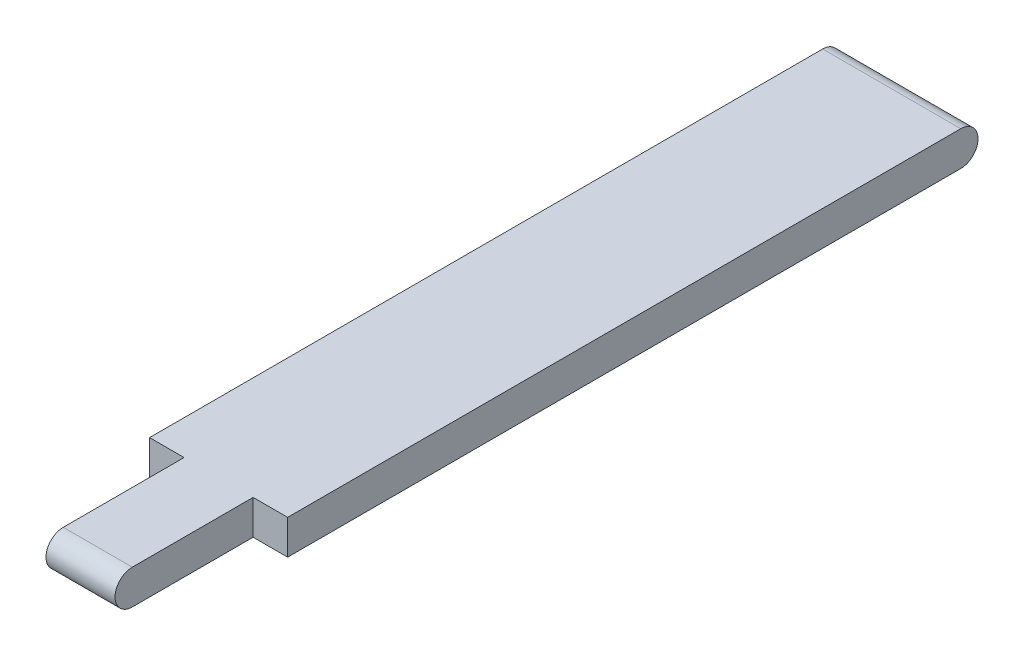
ISO-10303-21;
HEADER;
FILE_DESCRIPTION(('STEP AP214'),'2;1');
FILE_NAME('part.step','',(''),(''),'','','');
FILE_SCHEMA(('AUTOMOTIVE_DESIGN { 1 0 10303 214 1 1 1 1 }'));
ENDSEC;
DATA;
#1=APPLICATION_CONTEXT('core data for automotive mechanical design processes');
#2=APPLICATION_PROTOCOL_DEFINITION('international standard','automotive_design',2000,#1);
#3=PRODUCT_CONTEXT('',#1,'mechanical');
#4=PRODUCT('Part','Part','',(#3));
#5=PRODUCT_RELATED_PRODUCT_CATEGORY('part','',(#4));
#6=PRODUCT_DEFINITION_FORMATION('','',#4);
#7=PRODUCT_DEFINITION_CONTEXT('part definition',#1,'design');
#8=PRODUCT_DEFINITION('design','',#6,#7);
#9=PRODUCT_DEFINITION_SHAPE('','',#8);
#10=(LENGTH_UNIT() NAMED_UNIT(*) SI_UNIT(.MILLI.,.METRE.));
#11=(NAMED_UNIT(*) PLANE_ANGLE_UNIT() SI_UNIT($,.RADIAN.));
#12=(NAMED_UNIT(*) SI_UNIT($,.STERADIAN.) SOLID_ANGLE_UNIT());
#13=UNCERTAINTY_MEASURE_WITH_UNIT(LENGTH_MEASURE(1.E-05),#10,'distance_accuracy_value','');
#14=(GEOMETRIC_REPRESENTATION_CONTEXT(3) GLOBAL_UNCERTAINTY_ASSIGNED_CONTEXT((#13)) GLOBAL_UNIT_ASSIGNED_CONTEXT((#10,
#11,#12)) REPRESENTATION_CONTEXT('',''));
#15=CARTESIAN_POINT('',(0.,0.,0.));
#16=DIRECTION('',(0.,0.,1.));
#17=DIRECTION('',(1.,0.,0.));
#18=AXIS2_PLACEMENT_3D('',#15,#16,#17);
#19=CARTESIAN_POINT('',(4.,0.,23.));
#20=DIRECTION('',(-1.,0.,0.));
#21=DIRECTION('',(0.,0.,1.));
#22=AXIS2_PLACEMENT_3D('',#19,#20,#21);
#23=CYLINDRICAL_SURFACE('',#22,1.);
#24=DIRECTION('',(-1.,0.,0.));
#25=VECTOR('',#24,1.);
#26=CARTESIAN_POINT('',(4.,1.,23.));
#27=LINE('',#26,#25);
#28=CARTESIAN_POINT('',(2.,1.,23.));
#29=VERTEX_POINT('',#28);
#30=CARTESIAN_POINT('',(-2.,1.,23.));
#31=VERTEX_POINT('',#30);
#32=EDGE_CURVE('E146',#29,#31,#27,.T.);
#33=ORIENTED_EDGE('',*,*,#32,.T.);
#34=CARTESIAN_POINT('',(-2.,0.,23.));
#35=DIRECTION('',(1.,0.,0.));
#36=DIRECTION('',(0.,0.,-1.));
#37=AXIS2_PLACEMENT_3D('',#34,#35,#36);
#38=CIRCLE('',#37,1.);
#39=CARTESIAN_POINT('',(-2.,-1.,23.));
#40=VERTEX_POINT('',#39);
#41=EDGE_CURVE('E108',#31,#40,#38,.T.);
#42=ORIENTED_EDGE('',*,*,#41,.T.);
#43=DIRECTION('',(-1.,0.,0.));
#44=VECTOR('',#43,1.);
#45=CARTESIAN_POINT('',(4.,-1.,23.));
#46=LINE('',#45,#44);
#47=CARTESIAN_POINT('',(2.,-1.,23.));
#48=VERTEX_POINT('',#47);
#49=EDGE_CURVE('E157',#48,#40,#46,.T.);
#50=ORIENTED_EDGE('',*,*,#49,.F.);
#51=CARTESIAN_POINT('',(2.,0.,23.));
#52=DIRECTION('',(-1.,0.,0.));
#53=DIRECTION('',(0.,0.,1.));
#54=AXIS2_PLACEMENT_3D('',#51,#52,#53);
#55=CIRCLE('',#54,1.);
#56=EDGE_CURVE('E133',#48,#29,#55,.T.);
#57=ORIENTED_EDGE('',*,*,#56,.T.);
#58=EDGE_LOOP('',(#33,#42,#50,#57));
#59=FACE_BOUND('',#58,.T.);
#60=ADVANCED_FACE('F34',(#59),#23,.T.);
#61=CARTESIAN_POINT('',(4.,-1.,23.));
#62=DIRECTION('',(0.,1.,0.));
#63=DIRECTION('',(0.,0.,1.));
#64=AXIS2_PLACEMENT_3D('',#61,#62,#63);
#65=PLANE('',#64);
#66=DIRECTION('',(0.,0.,-1.));
#67=VECTOR('',#66,1.);
#68=CARTESIAN_POINT('',(-2.,-1.,23.));
#69=LINE('',#68,#67);
#70=CARTESIAN_POINT('',(-2.,-0.999999999999999,16.));
#71=VERTEX_POINT('',#70);
#72=EDGE_CURVE('E135',#40,#71,#69,.T.);
#73=ORIENTED_EDGE('',*,*,#72,.T.);
#74=DIRECTION('',(-1.,0.,0.));
#75=VECTOR('',#74,1.);
#76=CARTESIAN_POINT('',(4.,-0.999999999999999,16.));
#77=LINE('',#76,#75);
#78=CARTESIAN_POINT('',(-4.,-0.999999999999999,16.));
#79=VERTEX_POINT('',#78);
#80=EDGE_CURVE('E100',#71,#79,#77,.T.);
#81=ORIENTED_EDGE('',*,*,#80,.T.);
#82=DIRECTION('',(0.,0.,-1.));
#83=VECTOR('',#82,1.);
#84=CARTESIAN_POINT('',(-4.,-1.,23.));
#85=LINE('',#84,#83);
#86=CARTESIAN_POINT('',(-4.,-0.999999999999992,-23.));
#87=VERTEX_POINT('',#86);
#88=EDGE_CURVE('E138',#79,#87,#85,.T.);
#89=ORIENTED_EDGE('',*,*,#88,.T.);
#90=DIRECTION('',(-1.,0.,0.));
#91=VECTOR('',#90,1.);
#92=CARTESIAN_POINT('',(4.,-0.999999999999992,-23.));
#93=LINE('',#92,#91);
#94=CARTESIAN_POINT('',(4.,-0.999999999999992,-23.));
#95=VERTEX_POINT('',#94);
#96=EDGE_CURVE('E154',#95,#87,#93,.T.);
#97=ORIENTED_EDGE('',*,*,#96,.F.);
#98=DIRECTION('',(0.,0.,-1.));
#99=VECTOR('',#98,1.);
#100=CARTESIAN_POINT('',(4.,-1.,23.));
#101=LINE('',#100,#99);
#102=CARTESIAN_POINT('',(4.,-0.999999999999999,16.));
#103=VERTEX_POINT('',#102);
#104=EDGE_CURVE('E139',#103,#95,#101,.T.);
#105=ORIENTED_EDGE('',*,*,#104,.F.);
#106=DIRECTION('',(-1.,0.,0.));
#107=VECTOR('',#106,1.);
#108=CARTESIAN_POINT('',(4.,-0.999999999999999,16.));
#109=LINE('',#108,#107);
#110=CARTESIAN_POINT('',(2.,-0.999999999999999,16.));
#111=VERTEX_POINT('',#110);
#112=EDGE_CURVE('E47',#103,#111,#109,.T.);
#113=ORIENTED_EDGE('',*,*,#112,.T.);
#114=DIRECTION('',(0.,0.,1.));
#115=VECTOR('',#114,1.);
#116=CARTESIAN_POINT('',(2.,-1.,23.));
#117=LINE('',#116,#115);
#118=EDGE_CURVE('E130',#111,#48,#117,.T.);
#119=ORIENTED_EDGE('',*,*,#118,.T.);
#120=ORIENTED_EDGE('',*,*,#49,.T.);
#121=EDGE_LOOP('',(#73,#81,#89,#97,#105,#113,#119,#120));
#122=FACE_BOUND('',#121,.T.);
#123=ADVANCED_FACE('F164',(#122),#65,.F.);
#124=CARTESIAN_POINT('',(4.,0.,-23.));
#125=DIRECTION('',(-1.,0.,0.));
#126=DIRECTION('',(0.,0.,1.));
#127=AXIS2_PLACEMENT_3D('',#124,#125,#126);
#128=CYLINDRICAL_SURFACE('',#127,1.);
#129=CARTESIAN_POINT('',(-4.,0.,-23.));
#130=DIRECTION('',(1.,0.,0.));
#131=DIRECTION('',(0.,0.,-1.));
#132=AXIS2_PLACEMENT_3D('',#129,#130,#131);
#133=CIRCLE('',#132,1.);
#134=CARTESIAN_POINT('',(-4.,1.00000000000001,-23.));
#135=VERTEX_POINT('',#134);
#136=EDGE_CURVE('E148',#87,#135,#133,.T.);
#137=ORIENTED_EDGE('',*,*,#136,.T.);
#138=DIRECTION('',(-1.,0.,0.));
#139=VECTOR('',#138,1.);
#140=CARTESIAN_POINT('',(4.,1.00000000000001,-23.));
#141=LINE('',#140,#139);
#142=CARTESIAN_POINT('',(4.,1.00000000000001,-23.));
#143=VERTEX_POINT('',#142);
#144=EDGE_CURVE('E152',#143,#135,#141,.T.);
#145=ORIENTED_EDGE('',*,*,#144,.F.);
#146=CARTESIAN_POINT('',(4.,0.,-23.));
#147=DIRECTION('',(1.,0.,0.));
#148=DIRECTION('',(0.,0.,-1.));
#149=AXIS2_PLACEMENT_3D('',#146,#147,#148);
#150=CIRCLE('',#149,1.);
#151=EDGE_CURVE('E141',#95,#143,#150,.T.);
#152=ORIENTED_EDGE('',*,*,#151,.F.);
#153=ORIENTED_EDGE('',*,*,#96,.T.);
#154=EDGE_LOOP('',(#137,#145,#152,#153));
#155=FACE_BOUND('',#154,.T.);
#156=ADVANCED_FACE('F180',(#155),#128,.T.);
#157=CARTESIAN_POINT('',(4.,1.,23.));
#158=DIRECTION('',(0.,-1.,0.));
#159=DIRECTION('',(0.,0.,-1.));
#160=AXIS2_PLACEMENT_3D('',#157,#158,#159);
#161=PLANE('',#160);
#162=DIRECTION('',(0.,0.,1.));
#163=VECTOR('',#162,1.);
#164=CARTESIAN_POINT('',(-4.,1.,23.));
#165=LINE('',#164,#163);
#166=CARTESIAN_POINT('',(-4.,1.,16.));
#167=VERTEX_POINT('',#166);
#168=EDGE_CURVE('E118',#135,#167,#165,.T.);
#169=ORIENTED_EDGE('',*,*,#168,.T.);
#170=DIRECTION('',(-1.,0.,0.));
#171=VECTOR('',#170,1.);
#172=CARTESIAN_POINT('',(-4.,1.,16.));
#173=LINE('',#172,#171);
#174=CARTESIAN_POINT('',(-2.,1.,16.));
#175=VERTEX_POINT('',#174);
#176=EDGE_CURVE('E55',#175,#167,#173,.T.);
#177=ORIENTED_EDGE('',*,*,#176,.F.);
#178=DIRECTION('',(0.,0.,-1.));
#179=VECTOR('',#178,1.);
#180=CARTESIAN_POINT('',(-2.,1.,24.));
#181=LINE('',#180,#179);
#182=EDGE_CURVE('E106',#31,#175,#181,.T.);
#183=ORIENTED_EDGE('',*,*,#182,.F.);
#184=ORIENTED_EDGE('',*,*,#32,.F.);
#185=DIRECTION('',(0.,0.,1.));
#186=VECTOR('',#185,1.);
#187=CARTESIAN_POINT('',(2.,1.,24.));
#188=LINE('',#187,#186);
#189=CARTESIAN_POINT('',(2.,1.,16.));
#190=VERTEX_POINT('',#189);
#191=EDGE_CURVE('E124',#190,#29,#188,.T.);
#192=ORIENTED_EDGE('',*,*,#191,.F.);
#193=DIRECTION('',(-1.,0.,0.));
#194=VECTOR('',#193,1.);
#195=CARTESIAN_POINT('',(2.,1.,16.));
#196=LINE('',#195,#194);
#197=CARTESIAN_POINT('',(4.,1.,16.));
#198=VERTEX_POINT('',#197);
#199=EDGE_CURVE('E121',#198,#190,#196,.T.);
#200=ORIENTED_EDGE('',*,*,#199,.F.);
#201=DIRECTION('',(0.,0.,1.));
#202=VECTOR('',#201,1.);
#203=CARTESIAN_POINT('',(4.,1.,23.));
#204=LINE('',#203,#202);
#205=EDGE_CURVE('E143',#143,#198,#204,.T.);
#206=ORIENTED_EDGE('',*,*,#205,.F.);
#207=ORIENTED_EDGE('',*,*,#144,.T.);
#208=EDGE_LOOP('',(#169,#177,#183,#184,#192,#200,#206,#207));
#209=FACE_BOUND('',#208,.T.);
#210=ADVANCED_FACE('F115',(#209),#161,.F.);
#211=CARTESIAN_POINT('',(4.,0.,23.));
#212=DIRECTION('',(1.,0.,0.));
#213=DIRECTION('',(0.,0.,-1.));
#214=AXIS2_PLACEMENT_3D('',#211,#212,#213);
#215=PLANE('',#214);
#216=DIRECTION('',(0.,1.,0.));
#217=VECTOR('',#216,1.);
#218=CARTESIAN_POINT('',(4.,0.,16.));
#219=LINE('',#218,#217);
#220=EDGE_CURVE('E11',#103,#198,#219,.T.);
#221=ORIENTED_EDGE('',*,*,#220,.F.);
#222=ORIENTED_EDGE('',*,*,#104,.T.);
#223=ORIENTED_EDGE('',*,*,#151,.T.);
#224=ORIENTED_EDGE('',*,*,#205,.T.);
#225=EDGE_LOOP('',(#221,#222,#223,#224));
#226=FACE_BOUND('',#225,.T.);
#227=ADVANCED_FACE('F176',(#226),#215,.T.);
#228=CARTESIAN_POINT('',(-4.,0.,23.));
#229=DIRECTION('',(1.,0.,0.));
#230=DIRECTION('',(0.,0.,-1.));
#231=AXIS2_PLACEMENT_3D('',#228,#229,#230);
#232=PLANE('',#231);
#233=ORIENTED_EDGE('',*,*,#88,.F.);
#234=DIRECTION('',(0.,1.,0.));
#235=VECTOR('',#234,1.);
#236=CARTESIAN_POINT('',(-4.,0.,16.));
#237=LINE('',#236,#235);
#238=EDGE_CURVE('E41',#79,#167,#237,.T.);
#239=ORIENTED_EDGE('',*,*,#238,.T.);
#240=ORIENTED_EDGE('',*,*,#168,.F.);
#241=ORIENTED_EDGE('',*,*,#136,.F.);
#242=EDGE_LOOP('',(#233,#239,#240,#241));
#243=FACE_BOUND('',#242,.T.);
#244=ADVANCED_FACE('F161',(#243),#232,.F.);
#245=CARTESIAN_POINT('',(-2.,-9.,24.));
#246=DIRECTION('',(1.,0.,0.));
#247=DIRECTION('',(0.,0.,-1.));
#248=AXIS2_PLACEMENT_3D('',#245,#246,#247);
#249=PLANE('',#248);
#250=ORIENTED_EDGE('',*,*,#182,.T.);
#251=DIRECTION('',(0.,1.,0.));
#252=VECTOR('',#251,1.);
#253=CARTESIAN_POINT('',(-2.,-9.,16.));
#254=LINE('',#253,#252);
#255=EDGE_CURVE('E96',#71,#175,#254,.T.);
#256=ORIENTED_EDGE('',*,*,#255,.F.);
#257=ORIENTED_EDGE('',*,*,#72,.F.);
#258=ORIENTED_EDGE('',*,*,#41,.F.);
#259=EDGE_LOOP('',(#250,#256,#257,#258));
#260=FACE_BOUND('',#259,.T.);
#261=ADVANCED_FACE('F107',(#260),#249,.F.);
#262=CARTESIAN_POINT('',(-4.,-9.,16.));
#263=DIRECTION('',(0.,0.,-1.));
#264=DIRECTION('',(0.,1.,0.));
#265=AXIS2_PLACEMENT_3D('',#262,#263,#264);
#266=PLANE('',#265);
#267=ORIENTED_EDGE('',*,*,#255,.T.);
#268=ORIENTED_EDGE('',*,*,#176,.T.);
#269=ORIENTED_EDGE('',*,*,#238,.F.);
#270=ORIENTED_EDGE('',*,*,#80,.F.);
#271=EDGE_LOOP('',(#267,#268,#269,#270));
#272=FACE_BOUND('',#271,.T.);
#273=ADVANCED_FACE('F98',(#272),#266,.F.);
#274=CARTESIAN_POINT('',(2.,-9.,24.));
#275=DIRECTION('',(-1.,0.,0.));
#276=DIRECTION('',(0.,0.,1.));
#277=AXIS2_PLACEMENT_3D('',#274,#275,#276);
#278=PLANE('',#277);
#279=ORIENTED_EDGE('',*,*,#56,.F.);
#280=ORIENTED_EDGE('',*,*,#118,.F.);
#281=DIRECTION('',(0.,1.,0.));
#282=VECTOR('',#281,1.);
#283=CARTESIAN_POINT('',(2.,-9.,16.));
#284=LINE('',#283,#282);
#285=EDGE_CURVE('E112',#111,#190,#284,.T.);
#286=ORIENTED_EDGE('',*,*,#285,.T.);
#287=ORIENTED_EDGE('',*,*,#191,.T.);
#288=EDGE_LOOP('',(#279,#280,#286,#287));
#289=FACE_BOUND('',#288,.T.);
#290=ADVANCED_FACE('F172',(#289),#278,.F.);
#291=CARTESIAN_POINT('',(2.,-9.,16.));
#292=DIRECTION('',(0.,0.,-1.));
#293=DIRECTION('',(0.,1.,0.));
#294=AXIS2_PLACEMENT_3D('',#291,#292,#293);
#295=PLANE('',#294);
#296=ORIENTED_EDGE('',*,*,#220,.T.);
#297=ORIENTED_EDGE('',*,*,#199,.T.);
#298=ORIENTED_EDGE('',*,*,#285,.F.);
#299=ORIENTED_EDGE('',*,*,#112,.F.);
#300=EDGE_LOOP('',(#296,#297,#298,#299));
#301=FACE_BOUND('',#300,.T.);
#302=ADVANCED_FACE('F173',(#301),#295,.F.);
#303=CLOSED_SHELL('',(#60,#123,#156,#210,#227,#244,#261,#273,#290,#302));
#304=MANIFOLD_SOLID_BREP('B2',#303);
#305=ADVANCED_BREP_SHAPE_REPRESENTATION('',(#18,#304),#14);
#306=SHAPE_DEFINITION_REPRESENTATION(#9,#305);
ENDSEC;
END-ISO-10303-21;
